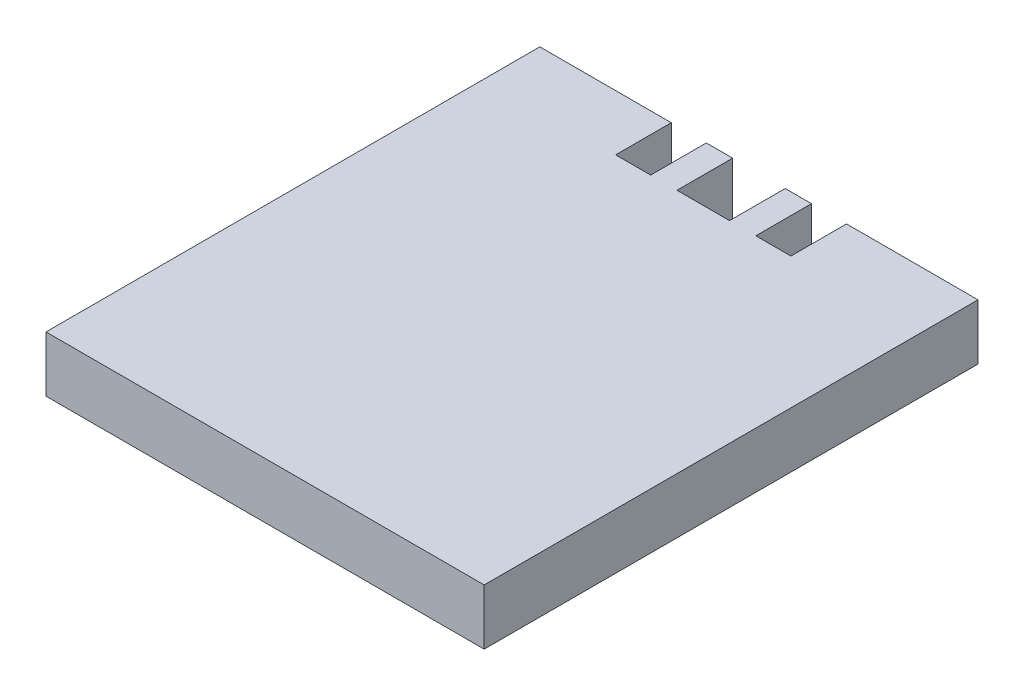
ISO-10303-21;
HEADER;
FILE_DESCRIPTION(('STEP AP214'),'2;1');
FILE_NAME('part.step','',(''),(''),'','','');
FILE_SCHEMA(('AUTOMOTIVE_DESIGN { 1 0 10303 214 1 1 1 1 }'));
ENDSEC;
DATA;
#1=APPLICATION_CONTEXT('core data for automotive mechanical design processes');
#2=APPLICATION_PROTOCOL_DEFINITION('international standard','automotive_design',2000,#1);
#3=PRODUCT_CONTEXT('',#1,'mechanical');
#4=PRODUCT('Part','Part','',(#3));
#5=PRODUCT_RELATED_PRODUCT_CATEGORY('part','',(#4));
#6=PRODUCT_DEFINITION_FORMATION('','',#4);
#7=PRODUCT_DEFINITION_CONTEXT('part definition',#1,'design');
#8=PRODUCT_DEFINITION('design','',#6,#7);
#9=PRODUCT_DEFINITION_SHAPE('','',#8);
#10=(LENGTH_UNIT() NAMED_UNIT(*) SI_UNIT(.MILLI.,.METRE.));
#11=(NAMED_UNIT(*) PLANE_ANGLE_UNIT() SI_UNIT($,.RADIAN.));
#12=(NAMED_UNIT(*) SI_UNIT($,.STERADIAN.) SOLID_ANGLE_UNIT());
#13=UNCERTAINTY_MEASURE_WITH_UNIT(LENGTH_MEASURE(1.E-05),#10,'distance_accuracy_value','');
#14=(GEOMETRIC_REPRESENTATION_CONTEXT(3) GLOBAL_UNCERTAINTY_ASSIGNED_CONTEXT((#13)) GLOBAL_UNIT_ASSIGNED_CONTEXT((#10,
#11,#12)) REPRESENTATION_CONTEXT('',''));
#15=CARTESIAN_POINT('',(0.,0.,0.));
#16=DIRECTION('',(0.,0.,1.));
#17=DIRECTION('',(1.,0.,0.));
#18=AXIS2_PLACEMENT_3D('',#15,#16,#17);
#19=CARTESIAN_POINT('',(0.,3.175,0.));
#20=DIRECTION('',(0.,0.,-1.));
#21=DIRECTION('',(-1.,0.,0.));
#22=AXIS2_PLACEMENT_3D('',#19,#20,#21);
#23=PLANE('',#22);
#24=DIRECTION('',(1.,0.,0.));
#25=VECTOR('',#24,1.);
#26=CARTESIAN_POINT('',(0.,0.,0.));
#27=LINE('',#26,#25);
#28=CARTESIAN_POINT('',(0.,0.,0.));
#29=VERTEX_POINT('',#28);
#30=CARTESIAN_POINT('',(25.,0.,0.));
#31=VERTEX_POINT('',#30);
#32=EDGE_CURVE('E180',#29,#31,#27,.T.);
#33=ORIENTED_EDGE('',*,*,#32,.T.);
#34=DIRECTION('',(0.,-1.,0.));
#35=VECTOR('',#34,1.);
#36=CARTESIAN_POINT('',(25.,3.175,0.));
#37=LINE('',#36,#35);
#38=CARTESIAN_POINT('',(25.,3.175,0.));
#39=VERTEX_POINT('',#38);
#40=EDGE_CURVE('E40',#39,#31,#37,.T.);
#41=ORIENTED_EDGE('',*,*,#40,.F.);
#42=DIRECTION('',(1.,0.,0.));
#43=VECTOR('',#42,1.);
#44=CARTESIAN_POINT('',(0.,3.175,0.));
#45=LINE('',#44,#43);
#46=CARTESIAN_POINT('',(0.,3.175,0.));
#47=VERTEX_POINT('',#46);
#48=EDGE_CURVE('E116',#47,#39,#45,.T.);
#49=ORIENTED_EDGE('',*,*,#48,.F.);
#50=DIRECTION('',(0.,-1.,0.));
#51=VECTOR('',#50,1.);
#52=CARTESIAN_POINT('',(0.,3.175,0.));
#53=LINE('',#52,#51);
#54=EDGE_CURVE('E11',#47,#29,#53,.T.);
#55=ORIENTED_EDGE('',*,*,#54,.T.);
#56=EDGE_LOOP('',(#33,#41,#49,#55));
#57=FACE_BOUND('',#56,.T.);
#58=ADVANCED_FACE('F32',(#57),#23,.F.);
#59=CARTESIAN_POINT('',(25.,3.175,-28.175));
#60=DIRECTION('',(-1.,0.,0.));
#61=DIRECTION('',(0.,0.,1.));
#62=AXIS2_PLACEMENT_3D('',#59,#60,#61);
#63=PLANE('',#62);
#64=DIRECTION('',(0.,0.,-1.));
#65=VECTOR('',#64,1.);
#66=CARTESIAN_POINT('',(25.,0.,-28.175));
#67=LINE('',#66,#65);
#68=CARTESIAN_POINT('',(25.,0.,-28.175));
#69=VERTEX_POINT('',#68);
#70=EDGE_CURVE('E183',#31,#69,#67,.T.);
#71=ORIENTED_EDGE('',*,*,#70,.T.);
#72=DIRECTION('',(0.,-1.,0.));
#73=VECTOR('',#72,1.);
#74=CARTESIAN_POINT('',(25.,3.175,-28.175));
#75=LINE('',#74,#73);
#76=CARTESIAN_POINT('',(25.,3.175,-28.175));
#77=VERTEX_POINT('',#76);
#78=EDGE_CURVE('E241',#77,#69,#75,.T.);
#79=ORIENTED_EDGE('',*,*,#78,.F.);
#80=DIRECTION('',(0.,0.,-1.));
#81=VECTOR('',#80,1.);
#82=CARTESIAN_POINT('',(25.,3.175,0.));
#83=LINE('',#82,#81);
#84=EDGE_CURVE('E248',#39,#77,#83,.T.);
#85=ORIENTED_EDGE('',*,*,#84,.F.);
#86=ORIENTED_EDGE('',*,*,#40,.T.);
#87=EDGE_LOOP('',(#71,#79,#85,#86));
#88=FACE_BOUND('',#87,.T.);
#89=ADVANCED_FACE('F246',(#88),#63,.F.);
#90=CARTESIAN_POINT('',(17.5,3.175,-28.175));
#91=DIRECTION('',(0.,0.,1.));
#92=DIRECTION('',(1.,0.,0.));
#93=AXIS2_PLACEMENT_3D('',#90,#91,#92);
#94=PLANE('',#93);
#95=DIRECTION('',(-1.,0.,0.));
#96=VECTOR('',#95,1.);
#97=CARTESIAN_POINT('',(17.5,0.,-28.175));
#98=LINE('',#97,#96);
#99=CARTESIAN_POINT('',(17.5,0.,-28.175));
#100=VERTEX_POINT('',#99);
#101=EDGE_CURVE('E185',#69,#100,#98,.T.);
#102=ORIENTED_EDGE('',*,*,#101,.T.);
#103=DIRECTION('',(0.,-1.,0.));
#104=VECTOR('',#103,1.);
#105=CARTESIAN_POINT('',(17.5,3.175,-28.175));
#106=LINE('',#105,#104);
#107=CARTESIAN_POINT('',(17.5,3.175,-28.175));
#108=VERTEX_POINT('',#107);
#109=EDGE_CURVE('E238',#108,#100,#106,.T.);
#110=ORIENTED_EDGE('',*,*,#109,.F.);
#111=DIRECTION('',(-1.,0.,0.));
#112=VECTOR('',#111,1.);
#113=CARTESIAN_POINT('',(17.5,3.175,-28.175));
#114=LINE('',#113,#112);
#115=EDGE_CURVE('E267',#77,#108,#114,.T.);
#116=ORIENTED_EDGE('',*,*,#115,.F.);
#117=ORIENTED_EDGE('',*,*,#78,.T.);
#118=EDGE_LOOP('',(#102,#110,#116,#117));
#119=FACE_BOUND('',#118,.T.);
#120=ADVANCED_FACE('F258',(#119),#94,.F.);
#121=CARTESIAN_POINT('',(17.5,3.175,-25.));
#122=DIRECTION('',(1.,0.,0.));
#123=DIRECTION('',(0.,0.,-1.));
#124=AXIS2_PLACEMENT_3D('',#121,#122,#123);
#125=PLANE('',#124);
#126=DIRECTION('',(0.,0.,1.));
#127=VECTOR('',#126,1.);
#128=CARTESIAN_POINT('',(17.5,0.,-25.));
#129=LINE('',#128,#127);
#130=CARTESIAN_POINT('',(17.5,0.,-25.));
#131=VERTEX_POINT('',#130);
#132=EDGE_CURVE('E187',#100,#131,#129,.T.);
#133=ORIENTED_EDGE('',*,*,#132,.T.);
#134=DIRECTION('',(0.,-1.,0.));
#135=VECTOR('',#134,1.);
#136=CARTESIAN_POINT('',(17.5,3.175,-25.));
#137=LINE('',#136,#135);
#138=CARTESIAN_POINT('',(17.5,3.175,-25.));
#139=VERTEX_POINT('',#138);
#140=EDGE_CURVE('E235',#139,#131,#137,.T.);
#141=ORIENTED_EDGE('',*,*,#140,.F.);
#142=DIRECTION('',(0.,0.,1.));
#143=VECTOR('',#142,1.);
#144=CARTESIAN_POINT('',(17.5,3.175,-25.));
#145=LINE('',#144,#143);
#146=EDGE_CURVE('E264',#108,#139,#145,.T.);
#147=ORIENTED_EDGE('',*,*,#146,.F.);
#148=ORIENTED_EDGE('',*,*,#109,.T.);
#149=EDGE_LOOP('',(#133,#141,#147,#148));
#150=FACE_BOUND('',#149,.T.);
#151=ADVANCED_FACE('F262',(#150),#125,.F.);
#152=CARTESIAN_POINT('',(15.5,3.175,-25.));
#153=DIRECTION('',(0.,0.,1.));
#154=DIRECTION('',(1.,0.,0.));
#155=AXIS2_PLACEMENT_3D('',#152,#153,#154);
#156=PLANE('',#155);
#157=DIRECTION('',(-1.,0.,0.));
#158=VECTOR('',#157,1.);
#159=CARTESIAN_POINT('',(15.5,0.,-25.));
#160=LINE('',#159,#158);
#161=CARTESIAN_POINT('',(15.5,0.,-25.));
#162=VERTEX_POINT('',#161);
#163=EDGE_CURVE('E189',#131,#162,#160,.T.);
#164=ORIENTED_EDGE('',*,*,#163,.T.);
#165=DIRECTION('',(0.,-1.,0.));
#166=VECTOR('',#165,1.);
#167=CARTESIAN_POINT('',(15.5,3.175,-25.));
#168=LINE('',#167,#166);
#169=CARTESIAN_POINT('',(15.5,3.175,-25.));
#170=VERTEX_POINT('',#169);
#171=EDGE_CURVE('E232',#170,#162,#168,.T.);
#172=ORIENTED_EDGE('',*,*,#171,.F.);
#173=DIRECTION('',(-1.,0.,0.));
#174=VECTOR('',#173,1.);
#175=CARTESIAN_POINT('',(15.5,3.175,-25.));
#176=LINE('',#175,#174);
#177=EDGE_CURVE('E266',#139,#170,#176,.T.);
#178=ORIENTED_EDGE('',*,*,#177,.F.);
#179=ORIENTED_EDGE('',*,*,#140,.T.);
#180=EDGE_LOOP('',(#164,#172,#178,#179));
#181=FACE_BOUND('',#180,.T.);
#182=ADVANCED_FACE('F318',(#181),#156,.F.);
#183=CARTESIAN_POINT('',(15.5,3.175,-28.175));
#184=DIRECTION('',(-1.,0.,0.));
#185=DIRECTION('',(0.,0.,1.));
#186=AXIS2_PLACEMENT_3D('',#183,#184,#185);
#187=PLANE('',#186);
#188=DIRECTION('',(0.,0.,-1.));
#189=VECTOR('',#188,1.);
#190=CARTESIAN_POINT('',(15.5,0.,-28.175));
#191=LINE('',#190,#189);
#192=CARTESIAN_POINT('',(15.5,0.,-28.175));
#193=VERTEX_POINT('',#192);
#194=EDGE_CURVE('E191',#162,#193,#191,.T.);
#195=ORIENTED_EDGE('',*,*,#194,.T.);
#196=DIRECTION('',(0.,-1.,0.));
#197=VECTOR('',#196,1.);
#198=CARTESIAN_POINT('',(15.5,3.175,-28.175));
#199=LINE('',#198,#197);
#200=CARTESIAN_POINT('',(15.5,3.175,-28.175));
#201=VERTEX_POINT('',#200);
#202=EDGE_CURVE('E229',#201,#193,#199,.T.);
#203=ORIENTED_EDGE('',*,*,#202,.F.);
#204=DIRECTION('',(0.,0.,-1.));
#205=VECTOR('',#204,1.);
#206=CARTESIAN_POINT('',(15.5,3.175,-28.175));
#207=LINE('',#206,#205);
#208=EDGE_CURVE('E269',#170,#201,#207,.T.);
#209=ORIENTED_EDGE('',*,*,#208,.F.);
#210=ORIENTED_EDGE('',*,*,#171,.T.);
#211=EDGE_LOOP('',(#195,#203,#209,#210));
#212=FACE_BOUND('',#211,.T.);
#213=ADVANCED_FACE('F315',(#212),#187,.F.);
#214=CARTESIAN_POINT('',(14.,3.175,-28.175));
#215=DIRECTION('',(0.,0.,1.));
#216=DIRECTION('',(1.,0.,0.));
#217=AXIS2_PLACEMENT_3D('',#214,#215,#216);
#218=PLANE('',#217);
#219=DIRECTION('',(-1.,0.,0.));
#220=VECTOR('',#219,1.);
#221=CARTESIAN_POINT('',(14.,0.,-28.175));
#222=LINE('',#221,#220);
#223=CARTESIAN_POINT('',(14.,0.,-28.175));
#224=VERTEX_POINT('',#223);
#225=EDGE_CURVE('E193',#193,#224,#222,.T.);
#226=ORIENTED_EDGE('',*,*,#225,.T.);
#227=DIRECTION('',(0.,-1.,0.));
#228=VECTOR('',#227,1.);
#229=CARTESIAN_POINT('',(14.,3.175,-28.175));
#230=LINE('',#229,#228);
#231=CARTESIAN_POINT('',(14.,3.175,-28.175));
#232=VERTEX_POINT('',#231);
#233=EDGE_CURVE('E226',#232,#224,#230,.T.);
#234=ORIENTED_EDGE('',*,*,#233,.F.);
#235=DIRECTION('',(-1.,0.,0.));
#236=VECTOR('',#235,1.);
#237=CARTESIAN_POINT('',(14.,3.175,-28.175));
#238=LINE('',#237,#236);
#239=EDGE_CURVE('E275',#201,#232,#238,.T.);
#240=ORIENTED_EDGE('',*,*,#239,.F.);
#241=ORIENTED_EDGE('',*,*,#202,.T.);
#242=EDGE_LOOP('',(#226,#234,#240,#241));
#243=FACE_BOUND('',#242,.T.);
#244=ADVANCED_FACE('F310',(#243),#218,.F.);
#245=CARTESIAN_POINT('',(14.,3.175,-25.));
#246=DIRECTION('',(1.,0.,0.));
#247=DIRECTION('',(0.,0.,-1.));
#248=AXIS2_PLACEMENT_3D('',#245,#246,#247);
#249=PLANE('',#248);
#250=DIRECTION('',(0.,0.,1.));
#251=VECTOR('',#250,1.);
#252=CARTESIAN_POINT('',(14.,0.,-25.));
#253=LINE('',#252,#251);
#254=CARTESIAN_POINT('',(14.,0.,-25.));
#255=VERTEX_POINT('',#254);
#256=EDGE_CURVE('E195',#224,#255,#253,.T.);
#257=ORIENTED_EDGE('',*,*,#256,.T.);
#258=DIRECTION('',(0.,-1.,0.));
#259=VECTOR('',#258,1.);
#260=CARTESIAN_POINT('',(14.,3.175,-25.));
#261=LINE('',#260,#259);
#262=CARTESIAN_POINT('',(14.,3.175,-25.));
#263=VERTEX_POINT('',#262);
#264=EDGE_CURVE('E223',#263,#255,#261,.T.);
#265=ORIENTED_EDGE('',*,*,#264,.F.);
#266=DIRECTION('',(0.,0.,1.));
#267=VECTOR('',#266,1.);
#268=CARTESIAN_POINT('',(14.,3.175,-25.));
#269=LINE('',#268,#267);
#270=EDGE_CURVE('E277',#232,#263,#269,.T.);
#271=ORIENTED_EDGE('',*,*,#270,.F.);
#272=ORIENTED_EDGE('',*,*,#233,.T.);
#273=EDGE_LOOP('',(#257,#265,#271,#272));
#274=FACE_BOUND('',#273,.T.);
#275=ADVANCED_FACE('F305',(#274),#249,.F.);
#276=CARTESIAN_POINT('',(11.,3.175,-25.));
#277=DIRECTION('',(0.,0.,1.));
#278=DIRECTION('',(1.,0.,0.));
#279=AXIS2_PLACEMENT_3D('',#276,#277,#278);
#280=PLANE('',#279);
#281=DIRECTION('',(-1.,0.,0.));
#282=VECTOR('',#281,1.);
#283=CARTESIAN_POINT('',(11.,0.,-25.));
#284=LINE('',#283,#282);
#285=CARTESIAN_POINT('',(11.,0.,-25.));
#286=VERTEX_POINT('',#285);
#287=EDGE_CURVE('E198',#255,#286,#284,.T.);
#288=ORIENTED_EDGE('',*,*,#287,.T.);
#289=DIRECTION('',(0.,-1.,0.));
#290=VECTOR('',#289,1.);
#291=CARTESIAN_POINT('',(11.,3.175,-25.));
#292=LINE('',#291,#290);
#293=CARTESIAN_POINT('',(11.,3.175,-25.));
#294=VERTEX_POINT('',#293);
#295=EDGE_CURVE('E220',#294,#286,#292,.T.);
#296=ORIENTED_EDGE('',*,*,#295,.F.);
#297=DIRECTION('',(-1.,0.,0.));
#298=VECTOR('',#297,1.);
#299=CARTESIAN_POINT('',(12.5,3.175,-25.));
#300=LINE('',#299,#298);
#301=EDGE_CURVE('E279',#263,#294,#300,.T.);
#302=ORIENTED_EDGE('',*,*,#301,.F.);
#303=ORIENTED_EDGE('',*,*,#264,.T.);
#304=EDGE_LOOP('',(#288,#296,#302,#303));
#305=FACE_BOUND('',#304,.T.);
#306=ADVANCED_FACE('F301',(#305),#280,.F.);
#307=CARTESIAN_POINT('',(11.,3.175,-25.));
#308=DIRECTION('',(-1.,0.,0.));
#309=DIRECTION('',(0.,0.,1.));
#310=AXIS2_PLACEMENT_3D('',#307,#308,#309);
#311=PLANE('',#310);
#312=DIRECTION('',(0.,0.,-1.));
#313=VECTOR('',#312,1.);
#314=CARTESIAN_POINT('',(11.,0.,-25.));
#315=LINE('',#314,#313);
#316=CARTESIAN_POINT('',(11.,0.,-28.175));
#317=VERTEX_POINT('',#316);
#318=EDGE_CURVE('E200',#286,#317,#315,.T.);
#319=ORIENTED_EDGE('',*,*,#318,.T.);
#320=DIRECTION('',(0.,-1.,0.));
#321=VECTOR('',#320,1.);
#322=CARTESIAN_POINT('',(11.,3.175,-28.175));
#323=LINE('',#322,#321);
#324=CARTESIAN_POINT('',(11.,3.175,-28.175));
#325=VERTEX_POINT('',#324);
#326=EDGE_CURVE('E217',#325,#317,#323,.T.);
#327=ORIENTED_EDGE('',*,*,#326,.F.);
#328=DIRECTION('',(0.,0.,-1.));
#329=VECTOR('',#328,1.);
#330=CARTESIAN_POINT('',(11.,3.175,-25.));
#331=LINE('',#330,#329);
#332=EDGE_CURVE('E281',#294,#325,#331,.T.);
#333=ORIENTED_EDGE('',*,*,#332,.F.);
#334=ORIENTED_EDGE('',*,*,#295,.T.);
#335=EDGE_LOOP('',(#319,#327,#333,#334));
#336=FACE_BOUND('',#335,.T.);
#337=ADVANCED_FACE('F297',(#336),#311,.F.);
#338=CARTESIAN_POINT('',(11.,3.175,-28.175));
#339=DIRECTION('',(0.,0.,1.));
#340=DIRECTION('',(1.,0.,0.));
#341=AXIS2_PLACEMENT_3D('',#338,#339,#340);
#342=PLANE('',#341);
#343=DIRECTION('',(-1.,0.,0.));
#344=VECTOR('',#343,1.);
#345=CARTESIAN_POINT('',(11.,0.,-28.175));
#346=LINE('',#345,#344);
#347=CARTESIAN_POINT('',(9.5,0.,-28.175));
#348=VERTEX_POINT('',#347);
#349=EDGE_CURVE('E202',#317,#348,#346,.T.);
#350=ORIENTED_EDGE('',*,*,#349,.T.);
#351=DIRECTION('',(0.,-1.,0.));
#352=VECTOR('',#351,1.);
#353=CARTESIAN_POINT('',(9.5,3.175,-28.175));
#354=LINE('',#353,#352);
#355=CARTESIAN_POINT('',(9.5,3.175,-28.175));
#356=VERTEX_POINT('',#355);
#357=EDGE_CURVE('E214',#356,#348,#354,.T.);
#358=ORIENTED_EDGE('',*,*,#357,.F.);
#359=DIRECTION('',(-1.,0.,0.));
#360=VECTOR('',#359,1.);
#361=CARTESIAN_POINT('',(11.,3.175,-28.175));
#362=LINE('',#361,#360);
#363=EDGE_CURVE('E283',#325,#356,#362,.T.);
#364=ORIENTED_EDGE('',*,*,#363,.F.);
#365=ORIENTED_EDGE('',*,*,#326,.T.);
#366=EDGE_LOOP('',(#350,#358,#364,#365));
#367=FACE_BOUND('',#366,.T.);
#368=ADVANCED_FACE('F289',(#367),#342,.F.);
#369=CARTESIAN_POINT('',(9.5,3.175,-28.175));
#370=DIRECTION('',(1.,0.,0.));
#371=DIRECTION('',(0.,0.,-1.));
#372=AXIS2_PLACEMENT_3D('',#369,#370,#371);
#373=PLANE('',#372);
#374=DIRECTION('',(0.,0.,1.));
#375=VECTOR('',#374,1.);
#376=CARTESIAN_POINT('',(9.5,0.,-28.175));
#377=LINE('',#376,#375);
#378=CARTESIAN_POINT('',(9.5,0.,-25.));
#379=VERTEX_POINT('',#378);
#380=EDGE_CURVE('E204',#348,#379,#377,.T.);
#381=ORIENTED_EDGE('',*,*,#380,.T.);
#382=DIRECTION('',(0.,-1.,0.));
#383=VECTOR('',#382,1.);
#384=CARTESIAN_POINT('',(9.5,3.175,-25.));
#385=LINE('',#384,#383);
#386=CARTESIAN_POINT('',(9.5,3.175,-25.));
#387=VERTEX_POINT('',#386);
#388=EDGE_CURVE('E169',#387,#379,#385,.T.);
#389=ORIENTED_EDGE('',*,*,#388,.F.);
#390=DIRECTION('',(0.,0.,1.));
#391=VECTOR('',#390,1.);
#392=CARTESIAN_POINT('',(9.5,3.175,-28.175));
#393=LINE('',#392,#391);
#394=EDGE_CURVE('E160',#356,#387,#393,.T.);
#395=ORIENTED_EDGE('',*,*,#394,.F.);
#396=ORIENTED_EDGE('',*,*,#357,.T.);
#397=EDGE_LOOP('',(#381,#389,#395,#396));
#398=FACE_BOUND('',#397,.T.);
#399=ADVANCED_FACE('F293',(#398),#373,.F.);
#400=CARTESIAN_POINT('',(7.5,3.175,-25.));
#401=DIRECTION('',(0.,0.,1.));
#402=DIRECTION('',(1.,0.,0.));
#403=AXIS2_PLACEMENT_3D('',#400,#401,#402);
#404=PLANE('',#403);
#405=DIRECTION('',(-1.,0.,0.));
#406=VECTOR('',#405,1.);
#407=CARTESIAN_POINT('',(7.5,0.,-25.));
#408=LINE('',#407,#406);
#409=CARTESIAN_POINT('',(7.5,0.,-25.));
#410=VERTEX_POINT('',#409);
#411=EDGE_CURVE('E168',#379,#410,#408,.T.);
#412=ORIENTED_EDGE('',*,*,#411,.T.);
#413=DIRECTION('',(0.,-1.,0.));
#414=VECTOR('',#413,1.);
#415=CARTESIAN_POINT('',(7.5,3.175,-25.));
#416=LINE('',#415,#414);
#417=CARTESIAN_POINT('',(7.5,3.175,-25.));
#418=VERTEX_POINT('',#417);
#419=EDGE_CURVE('E165',#418,#410,#416,.T.);
#420=ORIENTED_EDGE('',*,*,#419,.F.);
#421=DIRECTION('',(-1.,0.,0.));
#422=VECTOR('',#421,1.);
#423=CARTESIAN_POINT('',(7.5,3.175,-25.));
#424=LINE('',#423,#422);
#425=EDGE_CURVE('E154',#387,#418,#424,.T.);
#426=ORIENTED_EDGE('',*,*,#425,.F.);
#427=ORIENTED_EDGE('',*,*,#388,.T.);
#428=EDGE_LOOP('',(#412,#420,#426,#427));
#429=FACE_BOUND('',#428,.T.);
#430=ADVANCED_FACE('F166',(#429),#404,.F.);
#431=CARTESIAN_POINT('',(7.5,3.175,-25.));
#432=DIRECTION('',(-1.,0.,0.));
#433=DIRECTION('',(0.,0.,1.));
#434=AXIS2_PLACEMENT_3D('',#431,#432,#433);
#435=PLANE('',#434);
#436=DIRECTION('',(0.,0.,-1.));
#437=VECTOR('',#436,1.);
#438=CARTESIAN_POINT('',(7.5,0.,-25.));
#439=LINE('',#438,#437);
#440=CARTESIAN_POINT('',(7.5,0.,-28.175));
#441=VERTEX_POINT('',#440);
#442=EDGE_CURVE('E102',#410,#441,#439,.T.);
#443=ORIENTED_EDGE('',*,*,#442,.T.);
#444=DIRECTION('',(0.,-1.,0.));
#445=VECTOR('',#444,1.);
#446=CARTESIAN_POINT('',(7.5,3.175,-28.175));
#447=LINE('',#446,#445);
#448=CARTESIAN_POINT('',(7.5,3.175,-28.175));
#449=VERTEX_POINT('',#448);
#450=EDGE_CURVE('E170',#449,#441,#447,.T.);
#451=ORIENTED_EDGE('',*,*,#450,.F.);
#452=DIRECTION('',(0.,0.,-1.));
#453=VECTOR('',#452,1.);
#454=CARTESIAN_POINT('',(7.5,3.175,-25.));
#455=LINE('',#454,#453);
#456=EDGE_CURVE('E158',#418,#449,#455,.T.);
#457=ORIENTED_EDGE('',*,*,#456,.F.);
#458=ORIENTED_EDGE('',*,*,#419,.T.);
#459=EDGE_LOOP('',(#443,#451,#457,#458));
#460=FACE_BOUND('',#459,.T.);
#461=ADVANCED_FACE('F172',(#460),#435,.F.);
#462=CARTESIAN_POINT('',(7.5,3.175,-28.175));
#463=DIRECTION('',(0.,0.,1.));
#464=DIRECTION('',(1.,0.,0.));
#465=AXIS2_PLACEMENT_3D('',#462,#463,#464);
#466=PLANE('',#465);
#467=DIRECTION('',(-1.,0.,0.));
#468=VECTOR('',#467,1.);
#469=CARTESIAN_POINT('',(7.5,0.,-28.175));
#470=LINE('',#469,#468);
#471=CARTESIAN_POINT('',(0.,0.,-28.175));
#472=VERTEX_POINT('',#471);
#473=EDGE_CURVE('E109',#441,#472,#470,.T.);
#474=ORIENTED_EDGE('',*,*,#473,.T.);
#475=DIRECTION('',(0.,-1.,0.));
#476=VECTOR('',#475,1.);
#477=CARTESIAN_POINT('',(0.,3.175,-28.175));
#478=LINE('',#477,#476);
#479=CARTESIAN_POINT('',(0.,3.175,-28.175));
#480=VERTEX_POINT('',#479);
#481=EDGE_CURVE('E176',#480,#472,#478,.T.);
#482=ORIENTED_EDGE('',*,*,#481,.F.);
#483=DIRECTION('',(-1.,0.,0.));
#484=VECTOR('',#483,1.);
#485=CARTESIAN_POINT('',(7.5,3.175,-28.175));
#486=LINE('',#485,#484);
#487=EDGE_CURVE('E174',#449,#480,#486,.T.);
#488=ORIENTED_EDGE('',*,*,#487,.F.);
#489=ORIENTED_EDGE('',*,*,#450,.T.);
#490=EDGE_LOOP('',(#474,#482,#488,#489));
#491=FACE_BOUND('',#490,.T.);
#492=ADVANCED_FACE('F417',(#491),#466,.F.);
#493=CARTESIAN_POINT('',(0.,3.175,-28.175));
#494=DIRECTION('',(1.,0.,0.));
#495=DIRECTION('',(0.,0.,-1.));
#496=AXIS2_PLACEMENT_3D('',#493,#494,#495);
#497=PLANE('',#496);
#498=DIRECTION('',(0.,0.,1.));
#499=VECTOR('',#498,1.);
#500=CARTESIAN_POINT('',(0.,0.,-28.175));
#501=LINE('',#500,#499);
#502=EDGE_CURVE('E209',#472,#29,#501,.T.);
#503=ORIENTED_EDGE('',*,*,#502,.T.);
#504=ORIENTED_EDGE('',*,*,#54,.F.);
#505=DIRECTION('',(0.,0.,1.));
#506=VECTOR('',#505,1.);
#507=CARTESIAN_POINT('',(0.,3.175,0.));
#508=LINE('',#507,#506);
#509=EDGE_CURVE('E48',#480,#47,#508,.T.);
#510=ORIENTED_EDGE('',*,*,#509,.F.);
#511=ORIENTED_EDGE('',*,*,#481,.T.);
#512=EDGE_LOOP('',(#503,#504,#510,#511));
#513=FACE_BOUND('',#512,.T.);
#514=ADVANCED_FACE('F426',(#513),#497,.F.);
#515=CARTESIAN_POINT('',(0.,3.175,0.));
#516=DIRECTION('',(0.,1.,0.));
#517=DIRECTION('',(0.,0.,1.));
#518=AXIS2_PLACEMENT_3D('',#515,#516,#517);
#519=PLANE('',#518);
#520=ORIENTED_EDGE('',*,*,#509,.T.);
#521=ORIENTED_EDGE('',*,*,#48,.T.);
#522=ORIENTED_EDGE('',*,*,#84,.T.);
#523=ORIENTED_EDGE('',*,*,#115,.T.);
#524=ORIENTED_EDGE('',*,*,#146,.T.);
#525=ORIENTED_EDGE('',*,*,#177,.T.);
#526=ORIENTED_EDGE('',*,*,#208,.T.);
#527=ORIENTED_EDGE('',*,*,#239,.T.);
#528=ORIENTED_EDGE('',*,*,#270,.T.);
#529=ORIENTED_EDGE('',*,*,#301,.T.);
#530=ORIENTED_EDGE('',*,*,#332,.T.);
#531=ORIENTED_EDGE('',*,*,#363,.T.);
#532=ORIENTED_EDGE('',*,*,#394,.T.);
#533=ORIENTED_EDGE('',*,*,#425,.T.);
#534=ORIENTED_EDGE('',*,*,#456,.T.);
#535=ORIENTED_EDGE('',*,*,#487,.T.);
#536=EDGE_LOOP('',(#520,#521,#522,#523,#524,#525,#526,#527,#528,#529,#530,#531,#532,#533,#534,#535));
#537=FACE_BOUND('',#536,.T.);
#538=ADVANCED_FACE('F156',(#537),#519,.T.);
#539=CARTESIAN_POINT('',(0.,0.,0.));
#540=DIRECTION('',(0.,1.,0.));
#541=DIRECTION('',(0.,0.,1.));
#542=AXIS2_PLACEMENT_3D('',#539,#540,#541);
#543=PLANE('',#542);
#544=ORIENTED_EDGE('',*,*,#32,.F.);
#545=ORIENTED_EDGE('',*,*,#502,.F.);
#546=ORIENTED_EDGE('',*,*,#473,.F.);
#547=ORIENTED_EDGE('',*,*,#442,.F.);
#548=ORIENTED_EDGE('',*,*,#411,.F.);
#549=ORIENTED_EDGE('',*,*,#380,.F.);
#550=ORIENTED_EDGE('',*,*,#349,.F.);
#551=ORIENTED_EDGE('',*,*,#318,.F.);
#552=ORIENTED_EDGE('',*,*,#287,.F.);
#553=ORIENTED_EDGE('',*,*,#256,.F.);
#554=ORIENTED_EDGE('',*,*,#225,.F.);
#555=ORIENTED_EDGE('',*,*,#194,.F.);
#556=ORIENTED_EDGE('',*,*,#163,.F.);
#557=ORIENTED_EDGE('',*,*,#132,.F.);
#558=ORIENTED_EDGE('',*,*,#101,.F.);
#559=ORIENTED_EDGE('',*,*,#70,.F.);
#560=EDGE_LOOP('',(#544,#545,#546,#547,#548,#549,#550,#551,#552,#553,#554,#555,#556,#557,#558,#559));
#561=FACE_BOUND('',#560,.T.);
#562=ADVANCED_FACE('F252',(#561),#543,.F.);
#563=CLOSED_SHELL('',(#58,#89,#120,#151,#182,#213,#244,#275,#306,#337,#368,#399,#430,#461,#492,
#514,#538,#562));
#564=MANIFOLD_SOLID_BREP('B2',#563);
#565=ADVANCED_BREP_SHAPE_REPRESENTATION('',(#18,#564),#14);
#566=SHAPE_DEFINITION_REPRESENTATION(#9,#565);
ENDSEC;
END-ISO-10303-21;
